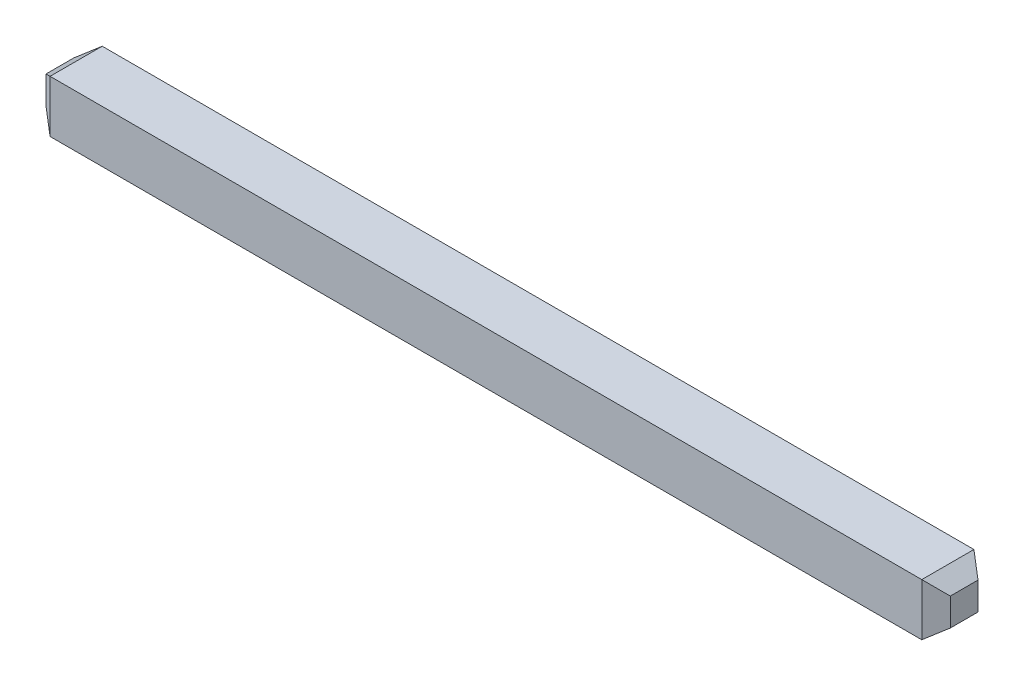
ISO-10303-21;
HEADER;
FILE_DESCRIPTION(('STEP AP214'),'2;1');
FILE_NAME('part.step','',(''),(''),'','','');
FILE_SCHEMA(('AUTOMOTIVE_DESIGN { 1 0 10303 214 1 1 1 1 }'));
ENDSEC;
DATA;
#1=APPLICATION_CONTEXT('core data for automotive mechanical design processes');
#2=APPLICATION_PROTOCOL_DEFINITION('international standard','automotive_design',2000,#1);
#3=PRODUCT_CONTEXT('',#1,'mechanical');
#4=PRODUCT('Part','Part','',(#3));
#5=PRODUCT_RELATED_PRODUCT_CATEGORY('part','',(#4));
#6=PRODUCT_DEFINITION_FORMATION('','',#4);
#7=PRODUCT_DEFINITION_CONTEXT('part definition',#1,'design');
#8=PRODUCT_DEFINITION('design','',#6,#7);
#9=PRODUCT_DEFINITION_SHAPE('','',#8);
#10=(LENGTH_UNIT() NAMED_UNIT(*) SI_UNIT(.MILLI.,.METRE.));
#11=(NAMED_UNIT(*) PLANE_ANGLE_UNIT() SI_UNIT($,.RADIAN.));
#12=(NAMED_UNIT(*) SI_UNIT($,.STERADIAN.) SOLID_ANGLE_UNIT());
#13=UNCERTAINTY_MEASURE_WITH_UNIT(LENGTH_MEASURE(1.E-05),#10,'distance_accuracy_value','');
#14=(GEOMETRIC_REPRESENTATION_CONTEXT(3) GLOBAL_UNCERTAINTY_ASSIGNED_CONTEXT((#13)) GLOBAL_UNIT_ASSIGNED_CONTEXT((#10,
#11,#12)) REPRESENTATION_CONTEXT('',''));
#15=CARTESIAN_POINT('',(0.,0.,0.));
#16=DIRECTION('',(0.,0.,1.));
#17=DIRECTION('',(1.,0.,0.));
#18=AXIS2_PLACEMENT_3D('',#15,#16,#17);
#19=CARTESIAN_POINT('',(-2.4,1.23,-29.455));
#20=DIRECTION('',(0.5999999999908,0.,0.8000000000069));
#21=DIRECTION('',(0.8000000000069,0.,-0.5999999999908));
#22=AXIS2_PLACEMENT_3D('',#19,#20,#21);
#23=PLANE('',#22);
#24=DIRECTION('',(0.,1.,0.));
#25=VECTOR('',#24,1.);
#26=CARTESIAN_POINT('',(-2.3,1.23,-29.53));
#27=LINE('',#26,#25);
#28=CARTESIAN_POINT('',(-2.29999999999957,1.55,-29.5299999999994));
#29=VERTEX_POINT('',#28);
#30=CARTESIAN_POINT('',(-2.29999999999958,0.909999999999898,-29.5299999999994));
#31=VERTEX_POINT('',#30);
#32=EDGE_CURVE('E101',#29,#31,#27,.F.);
#33=ORIENTED_EDGE('',*,*,#32,.T.);
#34=DIRECTION('',(-0.685994340569491,0.51449575542834,0.514495755427438));
#35=VECTOR('',#34,1.);
#36=CARTESIAN_POINT('',(-2.30000000000009,0.909999999999786,-29.53));
#37=LINE('',#36,#35);
#38=CARTESIAN_POINT('',(-2.50000000000021,1.06000000000001,-29.3800000000003));
#39=VERTEX_POINT('',#38);
#40=EDGE_CURVE('E85',#31,#39,#37,.T.);
#41=ORIENTED_EDGE('',*,*,#40,.T.);
#42=DIRECTION('',(0.,1.,0.));
#43=VECTOR('',#42,1.);
#44=CARTESIAN_POINT('',(-2.5,1.23,-29.38));
#45=LINE('',#44,#43);
#46=CARTESIAN_POINT('',(-2.50000000000043,1.4,-29.3800000000006));
#47=VERTEX_POINT('',#46);
#48=EDGE_CURVE('E79',#39,#47,#45,.T.);
#49=ORIENTED_EDGE('',*,*,#48,.T.);
#50=DIRECTION('',(-0.685994340570034,-0.514495755427526,0.514495755427528));
#51=VECTOR('',#50,1.);
#52=CARTESIAN_POINT('',(-2.3,1.55,-29.53));
#53=LINE('',#52,#51);
#54=EDGE_CURVE('E20',#29,#47,#53,.T.);
#55=ORIENTED_EDGE('',*,*,#54,.F.);
#56=EDGE_LOOP('',(#33,#41,#49,#55));
#57=FACE_BOUND('',#56,.T.);
#58=ADVANCED_FACE('F17',(#57),#23,.F.);
#59=CARTESIAN_POINT('',(8.5,1.23,-29.455));
#60=DIRECTION('',(-0.5999999999908,0.,0.8000000000069));
#61=DIRECTION('',(0.8000000000069,0.,0.5999999999908));
#62=AXIS2_PLACEMENT_3D('',#59,#60,#61);
#63=PLANE('',#62);
#64=DIRECTION('',(0.,1.,0.));
#65=VECTOR('',#64,1.);
#66=CARTESIAN_POINT('',(8.6,1.23,-29.38));
#67=LINE('',#66,#65);
#68=CARTESIAN_POINT('',(8.6000000000002,1.06000000000003,-29.3800000000003));
#69=VERTEX_POINT('',#68);
#70=CARTESIAN_POINT('',(8.60000000000043,1.4,-29.3800000000006));
#71=VERTEX_POINT('',#70);
#72=EDGE_CURVE('E113',#69,#71,#67,.T.);
#73=ORIENTED_EDGE('',*,*,#72,.F.);
#74=DIRECTION('',(-0.685994340569492,-0.51449575542834,-0.514495755427437));
#75=VECTOR('',#74,1.);
#76=CARTESIAN_POINT('',(8.59999999999996,1.06000000000005,-29.38));
#77=LINE('',#76,#75);
#78=CARTESIAN_POINT('',(8.39999999999959,0.909999999999884,-29.5299999999994));
#79=VERTEX_POINT('',#78);
#80=EDGE_CURVE('E108',#69,#79,#77,.T.);
#81=ORIENTED_EDGE('',*,*,#80,.T.);
#82=DIRECTION('',(0.,1.,0.));
#83=VECTOR('',#82,1.);
#84=CARTESIAN_POINT('',(8.4,1.23,-29.53));
#85=LINE('',#84,#83);
#86=CARTESIAN_POINT('',(8.39999999999957,1.55,-29.5299999999994));
#87=VERTEX_POINT('',#86);
#88=EDGE_CURVE('E99',#79,#87,#85,.T.);
#89=ORIENTED_EDGE('',*,*,#88,.T.);
#90=DIRECTION('',(-0.685994340570033,0.514495755427525,-0.514495755427531));
#91=VECTOR('',#90,1.);
#92=CARTESIAN_POINT('',(8.6,1.4,-29.38));
#93=LINE('',#92,#91);
#94=EDGE_CURVE('E116',#71,#87,#93,.T.);
#95=ORIENTED_EDGE('',*,*,#94,.F.);
#96=EDGE_LOOP('',(#73,#81,#89,#95));
#97=FACE_BOUND('',#96,.T.);
#98=ADVANCED_FACE('F214',(#97),#63,.F.);
#99=CARTESIAN_POINT('',(-2.4,1.475,-29.21));
#100=DIRECTION('',(-0.6,0.8,0.));
#101=DIRECTION('',(-0.8,-0.6,0.));
#102=AXIS2_PLACEMENT_3D('',#99,#100,#101);
#103=PLANE('',#102);
#104=DIRECTION('',(-0.685994340575992,-0.514495755427529,-0.514495755419582));
#105=VECTOR('',#104,1.);
#106=CARTESIAN_POINT('',(-2.29999999999913,1.55,-28.8900000000012));
#107=LINE('',#106,#105);
#108=CARTESIAN_POINT('',(-2.29999999999989,1.55,-28.8900000000001));
#109=VERTEX_POINT('',#108);
#110=CARTESIAN_POINT('',(-2.50000000000022,1.4,-29.0399999999997));
#111=VERTEX_POINT('',#110);
#112=EDGE_CURVE('E128',#109,#111,#107,.T.);
#113=ORIENTED_EDGE('',*,*,#112,.F.);
#114=DIRECTION('',(0.,0.,1.));
#115=VECTOR('',#114,1.);
#116=CARTESIAN_POINT('',(-2.3,1.55,-29.21));
#117=LINE('',#116,#115);
#118=EDGE_CURVE('E93',#29,#109,#117,.T.);
#119=ORIENTED_EDGE('',*,*,#118,.F.);
#120=ORIENTED_EDGE('',*,*,#54,.T.);
#121=DIRECTION('',(0.,0.,-1.));
#122=VECTOR('',#121,1.);
#123=CARTESIAN_POINT('',(-2.5,1.4,-29.21));
#124=LINE('',#123,#122);
#125=EDGE_CURVE('E87',#47,#111,#124,.F.);
#126=ORIENTED_EDGE('',*,*,#125,.T.);
#127=EDGE_LOOP('',(#113,#119,#120,#126));
#128=FACE_BOUND('',#127,.T.);
#129=ADVANCED_FACE('F90',(#128),#103,.T.);
#130=CARTESIAN_POINT('',(-2.5,1.23,-29.21));
#131=DIRECTION('',(1.,0.,0.));
#132=DIRECTION('',(0.,0.,-1.));
#133=AXIS2_PLACEMENT_3D('',#130,#131,#132);
#134=PLANE('',#133);
#135=DIRECTION('',(0.,1.,0.));
#136=VECTOR('',#135,1.);
#137=CARTESIAN_POINT('',(-2.50000000000087,1.23,-29.0399999999988));
#138=LINE('',#137,#136);
#139=CARTESIAN_POINT('',(-2.50000000000021,1.06000000000001,-29.0399999999997));
#140=VERTEX_POINT('',#139);
#141=EDGE_CURVE('E97',#111,#140,#138,.F.);
#142=ORIENTED_EDGE('',*,*,#141,.F.);
#143=ORIENTED_EDGE('',*,*,#125,.F.);
#144=ORIENTED_EDGE('',*,*,#48,.F.);
#145=DIRECTION('',(0.,0.,1.));
#146=VECTOR('',#145,1.);
#147=CARTESIAN_POINT('',(-2.49999999999996,1.06000000000005,-29.21));
#148=LINE('',#147,#146);
#149=EDGE_CURVE('E105',#39,#140,#148,.T.);
#150=ORIENTED_EDGE('',*,*,#149,.T.);
#151=EDGE_LOOP('',(#142,#143,#144,#150));
#152=FACE_BOUND('',#151,.T.);
#153=ADVANCED_FACE('F95',(#152),#134,.F.);
#154=CARTESIAN_POINT('',(3.05,1.23,-29.53));
#155=DIRECTION('',(0.,0.,1.));
#156=DIRECTION('',(1.,0.,0.));
#157=AXIS2_PLACEMENT_3D('',#154,#155,#156);
#158=PLANE('',#157);
#159=ORIENTED_EDGE('',*,*,#32,.F.);
#160=DIRECTION('',(1.,0.,0.));
#161=VECTOR('',#160,1.);
#162=CARTESIAN_POINT('',(3.05,1.55,-29.53));
#163=LINE('',#162,#161);
#164=EDGE_CURVE('E122',#87,#29,#163,.F.);
#165=ORIENTED_EDGE('',*,*,#164,.F.);
#166=ORIENTED_EDGE('',*,*,#88,.F.);
#167=DIRECTION('',(1.,0.,0.));
#168=VECTOR('',#167,1.);
#169=CARTESIAN_POINT('',(3.05,0.91,-29.53));
#170=LINE('',#169,#168);
#171=EDGE_CURVE('E136',#79,#31,#170,.F.);
#172=ORIENTED_EDGE('',*,*,#171,.T.);
#173=EDGE_LOOP('',(#159,#165,#166,#172));
#174=FACE_BOUND('',#173,.T.);
#175=ADVANCED_FACE('F182',(#174),#158,.F.);
#176=CARTESIAN_POINT('',(-2.4,0.9849999999999,-29.21));
#177=DIRECTION('',(0.600000000000912,0.799999999999316,0.));
#178=DIRECTION('',(-0.799999999999316,0.600000000000912,0.));
#179=AXIS2_PLACEMENT_3D('',#176,#177,#178);
#180=PLANE('',#179);
#181=DIRECTION('',(0.,0.,1.));
#182=VECTOR('',#181,1.);
#183=CARTESIAN_POINT('',(-2.3,0.91,-29.21));
#184=LINE('',#183,#182);
#185=CARTESIAN_POINT('',(-2.29999999999983,0.909999999999856,-28.8900000000003));
#186=VERTEX_POINT('',#185);
#187=EDGE_CURVE('E139',#31,#186,#184,.T.);
#188=ORIENTED_EDGE('',*,*,#187,.T.);
#189=DIRECTION('',(0.68599434057587,-0.514495755427782,0.514495755419491));
#190=VECTOR('',#189,1.);
#191=CARTESIAN_POINT('',(-2.50000000000087,1.06,-29.0399999999988));
#192=LINE('',#191,#190);
#193=EDGE_CURVE('E131',#140,#186,#192,.T.);
#194=ORIENTED_EDGE('',*,*,#193,.F.);
#195=ORIENTED_EDGE('',*,*,#149,.F.);
#196=ORIENTED_EDGE('',*,*,#40,.F.);
#197=EDGE_LOOP('',(#188,#194,#195,#196));
#198=FACE_BOUND('',#197,.T.);
#199=ADVANCED_FACE('F179',(#198),#180,.F.);
#200=CARTESIAN_POINT('',(8.5,0.9849999999999,-29.21));
#201=DIRECTION('',(-0.600000000000912,0.799999999999316,0.));
#202=DIRECTION('',(-0.799999999999316,-0.600000000000912,0.));
#203=AXIS2_PLACEMENT_3D('',#200,#201,#202);
#204=PLANE('',#203);
#205=DIRECTION('',(0.,0.,-1.));
#206=VECTOR('',#205,1.);
#207=CARTESIAN_POINT('',(8.6,1.06,-29.21));
#208=LINE('',#207,#206);
#209=CARTESIAN_POINT('',(8.6000000000002,1.06000000000003,-29.0399999999997));
#210=VERTEX_POINT('',#209);
#211=EDGE_CURVE('E110',#210,#69,#208,.T.);
#212=ORIENTED_EDGE('',*,*,#211,.F.);
#213=DIRECTION('',(0.685994340575871,0.514495755427787,-0.514495755419485));
#214=VECTOR('',#213,1.);
#215=CARTESIAN_POINT('',(8.39999999999913,0.9099999999999,-28.8900000000012));
#216=LINE('',#215,#214);
#217=CARTESIAN_POINT('',(8.39999999999993,0.909999999999868,-28.8900000000001));
#218=VERTEX_POINT('',#217);
#219=EDGE_CURVE('E35',#218,#210,#216,.T.);
#220=ORIENTED_EDGE('',*,*,#219,.F.);
#221=DIRECTION('',(0.,0.,1.));
#222=VECTOR('',#221,1.);
#223=CARTESIAN_POINT('',(8.4,0.91,-29.21));
#224=LINE('',#223,#222);
#225=EDGE_CURVE('E134',#218,#79,#224,.F.);
#226=ORIENTED_EDGE('',*,*,#225,.T.);
#227=ORIENTED_EDGE('',*,*,#80,.F.);
#228=EDGE_LOOP('',(#212,#220,#226,#227));
#229=FACE_BOUND('',#228,.T.);
#230=ADVANCED_FACE('F181',(#229),#204,.F.);
#231=CARTESIAN_POINT('',(8.6,1.23,-29.21));
#232=DIRECTION('',(1.,0.,0.));
#233=DIRECTION('',(0.,0.,-1.));
#234=AXIS2_PLACEMENT_3D('',#231,#232,#233);
#235=PLANE('',#234);
#236=ORIENTED_EDGE('',*,*,#72,.T.);
#237=DIRECTION('',(0.,0.,1.));
#238=VECTOR('',#237,1.);
#239=CARTESIAN_POINT('',(8.6,1.4,-29.21));
#240=LINE('',#239,#238);
#241=CARTESIAN_POINT('',(8.60000000000022,1.4,-29.0399999999997));
#242=VERTEX_POINT('',#241);
#243=EDGE_CURVE('E119',#242,#71,#240,.F.);
#244=ORIENTED_EDGE('',*,*,#243,.F.);
#245=DIRECTION('',(0.,1.,0.));
#246=VECTOR('',#245,1.);
#247=CARTESIAN_POINT('',(8.60000000000087,1.23,-29.0399999999988));
#248=LINE('',#247,#246);
#249=EDGE_CURVE('E142',#210,#242,#248,.T.);
#250=ORIENTED_EDGE('',*,*,#249,.F.);
#251=ORIENTED_EDGE('',*,*,#211,.T.);
#252=EDGE_LOOP('',(#236,#244,#250,#251));
#253=FACE_BOUND('',#252,.T.);
#254=ADVANCED_FACE('F189',(#253),#235,.T.);
#255=CARTESIAN_POINT('',(8.5,1.475,-29.21));
#256=DIRECTION('',(0.6,0.8,0.));
#257=DIRECTION('',(-0.8,0.6,0.));
#258=AXIS2_PLACEMENT_3D('',#255,#256,#257);
#259=PLANE('',#258);
#260=DIRECTION('',(-0.685994340575992,0.514495755427535,0.514495755419576));
#261=VECTOR('',#260,1.);
#262=CARTESIAN_POINT('',(8.60000000000087,1.4,-29.0399999999988));
#263=LINE('',#262,#261);
#264=CARTESIAN_POINT('',(8.39999999999989,1.55,-28.8900000000001));
#265=VERTEX_POINT('',#264);
#266=EDGE_CURVE('E145',#242,#265,#263,.T.);
#267=ORIENTED_EDGE('',*,*,#266,.F.);
#268=ORIENTED_EDGE('',*,*,#243,.T.);
#269=ORIENTED_EDGE('',*,*,#94,.T.);
#270=DIRECTION('',(0.,0.,1.));
#271=VECTOR('',#270,1.);
#272=CARTESIAN_POINT('',(8.4,1.55,-29.21));
#273=LINE('',#272,#271);
#274=EDGE_CURVE('E125',#265,#87,#273,.F.);
#275=ORIENTED_EDGE('',*,*,#274,.F.);
#276=EDGE_LOOP('',(#267,#268,#269,#275));
#277=FACE_BOUND('',#276,.T.);
#278=ADVANCED_FACE('F170',(#277),#259,.T.);
#279=CARTESIAN_POINT('',(3.05,1.55,-29.21));
#280=DIRECTION('',(0.,1.,0.));
#281=DIRECTION('',(0.,0.,1.));
#282=AXIS2_PLACEMENT_3D('',#279,#280,#281);
#283=PLANE('',#282);
#284=DIRECTION('',(1.,0.,0.));
#285=VECTOR('',#284,1.);
#286=CARTESIAN_POINT('',(3.05,1.55,-28.89));
#287=LINE('',#286,#285);
#288=EDGE_CURVE('E148',#265,#109,#287,.F.);
#289=ORIENTED_EDGE('',*,*,#288,.F.);
#290=ORIENTED_EDGE('',*,*,#274,.T.);
#291=ORIENTED_EDGE('',*,*,#164,.T.);
#292=ORIENTED_EDGE('',*,*,#118,.T.);
#293=EDGE_LOOP('',(#289,#290,#291,#292));
#294=FACE_BOUND('',#293,.T.);
#295=ADVANCED_FACE('F173',(#294),#283,.T.);
#296=CARTESIAN_POINT('',(-2.4,1.23,-28.965));
#297=DIRECTION('',(-0.599999999990736,0.,0.800000000006948));
#298=DIRECTION('',(0.800000000006948,0.,0.599999999990736));
#299=AXIS2_PLACEMENT_3D('',#296,#297,#298);
#300=PLANE('',#299);
#301=ORIENTED_EDGE('',*,*,#193,.T.);
#302=DIRECTION('',(0.,1.,0.));
#303=VECTOR('',#302,1.);
#304=CARTESIAN_POINT('',(-2.3,1.23,-28.89));
#305=LINE('',#304,#303);
#306=EDGE_CURVE('E151',#109,#186,#305,.F.);
#307=ORIENTED_EDGE('',*,*,#306,.F.);
#308=ORIENTED_EDGE('',*,*,#112,.T.);
#309=ORIENTED_EDGE('',*,*,#141,.T.);
#310=EDGE_LOOP('',(#301,#307,#308,#309));
#311=FACE_BOUND('',#310,.T.);
#312=ADVANCED_FACE('F176',(#311),#300,.T.);
#313=CARTESIAN_POINT('',(3.05,0.91,-29.21));
#314=DIRECTION('',(0.,1.,0.));
#315=DIRECTION('',(0.,0.,1.));
#316=AXIS2_PLACEMENT_3D('',#313,#314,#315);
#317=PLANE('',#316);
#318=ORIENTED_EDGE('',*,*,#187,.F.);
#319=ORIENTED_EDGE('',*,*,#171,.F.);
#320=ORIENTED_EDGE('',*,*,#225,.F.);
#321=DIRECTION('',(1.,0.,0.));
#322=VECTOR('',#321,1.);
#323=CARTESIAN_POINT('',(3.05,0.9099999999999,-28.89));
#324=LINE('',#323,#322);
#325=EDGE_CURVE('E26',#186,#218,#324,.T.);
#326=ORIENTED_EDGE('',*,*,#325,.F.);
#327=EDGE_LOOP('',(#318,#319,#320,#326));
#328=FACE_BOUND('',#327,.T.);
#329=ADVANCED_FACE('F162',(#328),#317,.F.);
#330=CARTESIAN_POINT('',(8.5,1.23,-28.965));
#331=DIRECTION('',(0.599999999990736,0.,0.800000000006948));
#332=DIRECTION('',(0.800000000006948,0.,-0.599999999990736));
#333=AXIS2_PLACEMENT_3D('',#330,#331,#332);
#334=PLANE('',#333);
#335=ORIENTED_EDGE('',*,*,#266,.T.);
#336=DIRECTION('',(0.,1.,0.));
#337=VECTOR('',#336,1.);
#338=CARTESIAN_POINT('',(8.4,1.23,-28.89));
#339=LINE('',#338,#337);
#340=EDGE_CURVE('E11',#218,#265,#339,.T.);
#341=ORIENTED_EDGE('',*,*,#340,.F.);
#342=ORIENTED_EDGE('',*,*,#219,.T.);
#343=ORIENTED_EDGE('',*,*,#249,.T.);
#344=EDGE_LOOP('',(#335,#341,#342,#343));
#345=FACE_BOUND('',#344,.T.);
#346=ADVANCED_FACE('F166',(#345),#334,.T.);
#347=CARTESIAN_POINT('',(3.05,1.23,-28.89));
#348=DIRECTION('',(0.,0.,1.));
#349=DIRECTION('',(1.,0.,0.));
#350=AXIS2_PLACEMENT_3D('',#347,#348,#349);
#351=PLANE('',#350);
#352=ORIENTED_EDGE('',*,*,#325,.T.);
#353=ORIENTED_EDGE('',*,*,#340,.T.);
#354=ORIENTED_EDGE('',*,*,#288,.T.);
#355=ORIENTED_EDGE('',*,*,#306,.T.);
#356=EDGE_LOOP('',(#352,#353,#354,#355));
#357=FACE_BOUND('',#356,.T.);
#358=ADVANCED_FACE('F157',(#357),#351,.T.);
#359=CLOSED_SHELL('',(#58,#98,#129,#153,#175,#199,#230,#254,#278,#295,#312,#329,#346,#358));
#360=MANIFOLD_SOLID_BREP('B1',#359);
#361=ADVANCED_BREP_SHAPE_REPRESENTATION('',(#18,#360),#14);
#362=SHAPE_DEFINITION_REPRESENTATION(#9,#361);
ENDSEC;
END-ISO-10303-21;
